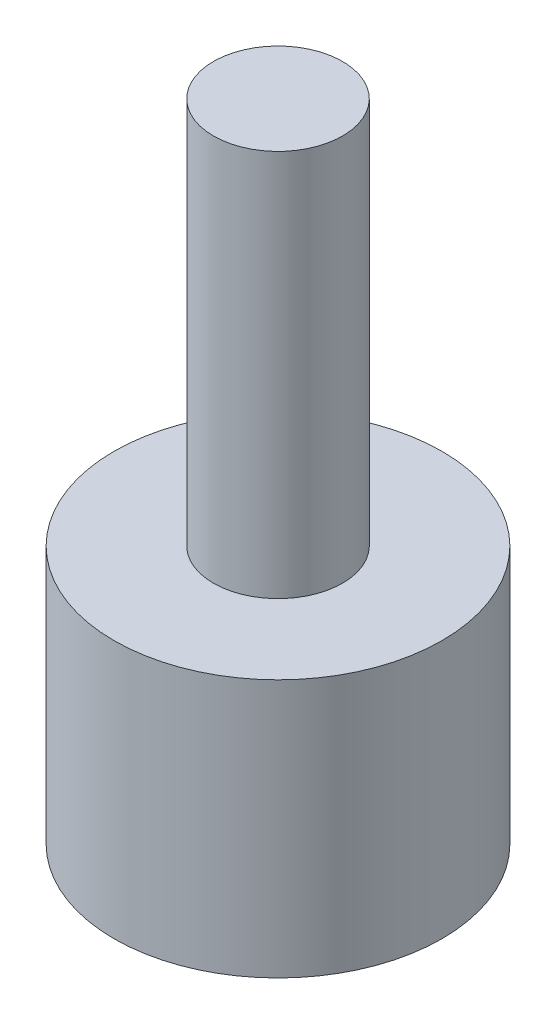
ISO-10303-21;
HEADER;
FILE_DESCRIPTION(('STEP AP214'),'2;1');
FILE_NAME('part.step','',(''),(''),'','','');
FILE_SCHEMA(('AUTOMOTIVE_DESIGN { 1 0 10303 214 1 1 1 1 }'));
ENDSEC;
DATA;
#1=APPLICATION_CONTEXT('core data for automotive mechanical design processes');
#2=APPLICATION_PROTOCOL_DEFINITION('international standard','automotive_design',2000,#1);
#3=PRODUCT_CONTEXT('',#1,'mechanical');
#4=PRODUCT('Part','Part','',(#3));
#5=PRODUCT_RELATED_PRODUCT_CATEGORY('part','',(#4));
#6=PRODUCT_DEFINITION_FORMATION('','',#4);
#7=PRODUCT_DEFINITION_CONTEXT('part definition',#1,'design');
#8=PRODUCT_DEFINITION('design','',#6,#7);
#9=PRODUCT_DEFINITION_SHAPE('','',#8);
#10=(LENGTH_UNIT() NAMED_UNIT(*) SI_UNIT(.MILLI.,.METRE.));
#11=(NAMED_UNIT(*) PLANE_ANGLE_UNIT() SI_UNIT($,.RADIAN.));
#12=(NAMED_UNIT(*) SI_UNIT($,.STERADIAN.) SOLID_ANGLE_UNIT());
#13=UNCERTAINTY_MEASURE_WITH_UNIT(LENGTH_MEASURE(1.E-05),#10,'distance_accuracy_value','');
#14=(GEOMETRIC_REPRESENTATION_CONTEXT(3) GLOBAL_UNCERTAINTY_ASSIGNED_CONTEXT((#13)) GLOBAL_UNIT_ASSIGNED_CONTEXT((#10,
#11,#12)) REPRESENTATION_CONTEXT('',''));
#15=CARTESIAN_POINT('',(0.,0.,0.));
#16=DIRECTION('',(0.,0.,1.));
#17=DIRECTION('',(1.,0.,0.));
#18=AXIS2_PLACEMENT_3D('',#15,#16,#17);
#19=CARTESIAN_POINT('',(0.,10.,0.));
#20=DIRECTION('',(0.,-1.,0.));
#21=DIRECTION('',(0.,0.,-1.));
#22=AXIS2_PLACEMENT_3D('',#19,#20,#21);
#23=CYLINDRICAL_SURFACE('',#22,6.35);
#24=CARTESIAN_POINT('',(0.,10.,0.));
#25=DIRECTION('',(0.,1.,0.));
#26=DIRECTION('',(0.,0.,1.));
#27=AXIS2_PLACEMENT_3D('',#24,#25,#26);
#28=CIRCLE('',#27,6.35);
#29=CARTESIAN_POINT('',(0.,10.,6.35));
#30=VERTEX_POINT('',#29);
#31=EDGE_CURVE('E42',#30,#30,#28,.T.);
#32=ORIENTED_EDGE('',*,*,#31,.F.);
#33=EDGE_LOOP('',(#32));
#34=FACE_BOUND('',#33,.T.);
#35=CARTESIAN_POINT('',(0.,0.,0.));
#36=DIRECTION('',(0.,1.,0.));
#37=DIRECTION('',(0.,0.,1.));
#38=AXIS2_PLACEMENT_3D('',#35,#36,#37);
#39=CIRCLE('',#38,6.35);
#40=CARTESIAN_POINT('',(0.,0.,6.35));
#41=VERTEX_POINT('',#40);
#42=EDGE_CURVE('E38',#41,#41,#39,.T.);
#43=ORIENTED_EDGE('',*,*,#42,.T.);
#44=EDGE_LOOP('',(#43));
#45=FACE_BOUND('',#44,.T.);
#46=ADVANCED_FACE('F35',(#34,#45),#23,.T.);
#47=CARTESIAN_POINT('',(0.,10.,0.));
#48=DIRECTION('',(0.,1.,0.));
#49=DIRECTION('',(0.,0.,1.));
#50=AXIS2_PLACEMENT_3D('',#47,#48,#49);
#51=PLANE('',#50);
#52=CARTESIAN_POINT('',(0.,10.,0.));
#53=DIRECTION('',(0.,1.,0.));
#54=DIRECTION('',(0.,0.,1.));
#55=AXIS2_PLACEMENT_3D('',#52,#53,#54);
#56=CIRCLE('',#55,2.5);
#57=CARTESIAN_POINT('',(0.,10.,2.5));
#58=VERTEX_POINT('',#57);
#59=EDGE_CURVE('E10',#58,#58,#56,.T.);
#60=ORIENTED_EDGE('',*,*,#59,.F.);
#61=EDGE_LOOP('',(#60));
#62=FACE_BOUND('',#61,.T.);
#63=ORIENTED_EDGE('',*,*,#31,.T.);
#64=EDGE_LOOP('',(#63));
#65=FACE_BOUND('',#64,.T.);
#66=ADVANCED_FACE('F59',(#62,#65),#51,.T.);
#67=CARTESIAN_POINT('',(0.,0.,0.));
#68=DIRECTION('',(0.,1.,0.));
#69=DIRECTION('',(0.,0.,1.));
#70=AXIS2_PLACEMENT_3D('',#67,#68,#69);
#71=PLANE('',#70);
#72=ORIENTED_EDGE('',*,*,#42,.F.);
#73=EDGE_LOOP('',(#72));
#74=FACE_BOUND('',#73,.T.);
#75=ADVANCED_FACE('F56',(#74),#71,.F.);
#76=CARTESIAN_POINT('',(0.,25.,0.));
#77=DIRECTION('',(0.,-1.,0.));
#78=DIRECTION('',(0.,0.,-1.));
#79=AXIS2_PLACEMENT_3D('',#76,#77,#78);
#80=CYLINDRICAL_SURFACE('',#79,2.5);
#81=CARTESIAN_POINT('',(0.,25.,0.));
#82=DIRECTION('',(0.,1.,0.));
#83=DIRECTION('',(0.,0.,1.));
#84=AXIS2_PLACEMENT_3D('',#81,#82,#83);
#85=CIRCLE('',#84,2.5);
#86=CARTESIAN_POINT('',(0.,25.,2.5));
#87=VERTEX_POINT('',#86);
#88=EDGE_CURVE('E48',#87,#87,#85,.T.);
#89=ORIENTED_EDGE('',*,*,#88,.F.);
#90=EDGE_LOOP('',(#89));
#91=FACE_BOUND('',#90,.T.);
#92=ORIENTED_EDGE('',*,*,#59,.T.);
#93=EDGE_LOOP('',(#92));
#94=FACE_BOUND('',#93,.T.);
#95=ADVANCED_FACE('F58',(#91,#94),#80,.T.);
#96=CARTESIAN_POINT('',(0.,25.,0.));
#97=DIRECTION('',(0.,1.,0.));
#98=DIRECTION('',(0.,0.,1.));
#99=AXIS2_PLACEMENT_3D('',#96,#97,#98);
#100=PLANE('',#99);
#101=ORIENTED_EDGE('',*,*,#88,.T.);
#102=EDGE_LOOP('',(#101));
#103=FACE_BOUND('',#102,.T.);
#104=ADVANCED_FACE('F64',(#103),#100,.T.);
#105=CLOSED_SHELL('',(#46,#66,#75,#95,#104));
#106=MANIFOLD_SOLID_BREP('B2',#105);
#107=ADVANCED_BREP_SHAPE_REPRESENTATION('',(#18,#106),#14);
#108=SHAPE_DEFINITION_REPRESENTATION(#9,#107);
ENDSEC;
END-ISO-10303-21;
